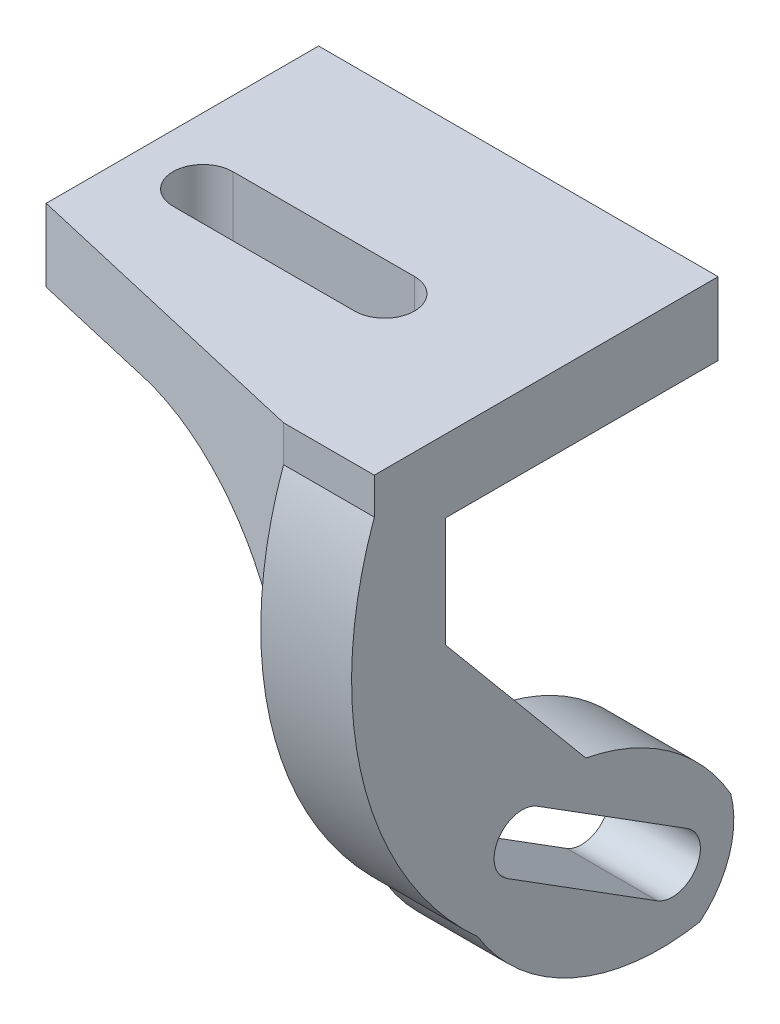
ISO-10303-21;
HEADER;
FILE_DESCRIPTION(('STEP AP214'),'2;1');
FILE_NAME('part.step','',(''),(''),'','','');
FILE_SCHEMA(('AUTOMOTIVE_DESIGN { 1 0 10303 214 1 1 1 1 }'));
ENDSEC;
DATA;
#1=APPLICATION_CONTEXT('core data for automotive mechanical design processes');
#2=APPLICATION_PROTOCOL_DEFINITION('international standard','automotive_design',2000,#1);
#3=PRODUCT_CONTEXT('',#1,'mechanical');
#4=PRODUCT('Part','Part','',(#3));
#5=PRODUCT_RELATED_PRODUCT_CATEGORY('part','',(#4));
#6=PRODUCT_DEFINITION_FORMATION('','',#4);
#7=PRODUCT_DEFINITION_CONTEXT('part definition',#1,'design');
#8=PRODUCT_DEFINITION('design','',#6,#7);
#9=PRODUCT_DEFINITION_SHAPE('','',#8);
#10=(LENGTH_UNIT() NAMED_UNIT(*) SI_UNIT(.MILLI.,.METRE.));
#11=(NAMED_UNIT(*) PLANE_ANGLE_UNIT() SI_UNIT($,.RADIAN.));
#12=(NAMED_UNIT(*) SI_UNIT($,.STERADIAN.) SOLID_ANGLE_UNIT());
#13=UNCERTAINTY_MEASURE_WITH_UNIT(LENGTH_MEASURE(1.E-05),#10,'distance_accuracy_value','');
#14=(GEOMETRIC_REPRESENTATION_CONTEXT(3) GLOBAL_UNCERTAINTY_ASSIGNED_CONTEXT((#13)) GLOBAL_UNIT_ASSIGNED_CONTEXT((#10,
#11,#12)) REPRESENTATION_CONTEXT('',''));
#15=CARTESIAN_POINT('',(0.,0.,0.));
#16=DIRECTION('',(0.,0.,1.));
#17=DIRECTION('',(1.,0.,0.));
#18=AXIS2_PLACEMENT_3D('',#15,#16,#17);
#19=CARTESIAN_POINT('',(0.,-5.17499782725623,-0.996742071947044));
#20=DIRECTION('',(1.,0.,0.));
#21=DIRECTION('',(0.,0.,-1.));
#22=AXIS2_PLACEMENT_3D('',#19,#20,#21);
#23=PLANE('',#22);
#24=CARTESIAN_POINT('',(0.,-22.7754113868742,2.52679453354434));
#25=DIRECTION('',(1.,0.,0.));
#26=DIRECTION('',(0.,0.,-1.));
#27=AXIS2_PLACEMENT_3D('',#24,#25,#26);
#28=CIRCLE('',#27,1.55);
#29=CARTESIAN_POINT('',(0.,-24.0876980381512,3.35166042863277));
#30=VERTEX_POINT('',#29);
#31=CARTESIAN_POINT('',(0.,-21.4631247355971,1.7019286384559));
#32=VERTEX_POINT('',#31);
#33=EDGE_CURVE('E327',#30,#32,#28,.T.);
#34=ORIENTED_EDGE('',*,*,#33,.T.);
#35=DIRECTION('',(0.,0.532171545218348,0.846636549211004));
#36=VECTOR('',#35,1.);
#37=CARTESIAN_POINT('',(0.,-21.4631247355971,1.7019286384559));
#38=LINE('',#37,#36);
#39=CARTESIAN_POINT('',(0.,-16.2710381983531,9.96206631134401));
#40=VERTEX_POINT('',#39);
#41=EDGE_CURVE('E324',#32,#40,#38,.T.);
#42=ORIENTED_EDGE('',*,*,#41,.T.);
#43=CARTESIAN_POINT('',(0.,-17.5833248496302,10.7869322064324));
#44=DIRECTION('',(1.,0.,0.));
#45=DIRECTION('',(0.,0.,-1.));
#46=AXIS2_PLACEMENT_3D('',#43,#44,#45);
#47=CIRCLE('',#46,1.55);
#48=CARTESIAN_POINT('',(0.,-18.8956115009073,11.6117981015209));
#49=VERTEX_POINT('',#48);
#50=EDGE_CURVE('E321',#40,#49,#47,.T.);
#51=ORIENTED_EDGE('',*,*,#50,.T.);
#52=DIRECTION('',(0.,-0.532171545218347,-0.846636549211004));
#53=VECTOR('',#52,1.);
#54=CARTESIAN_POINT('',(0.,-24.0876980381512,3.35166042863277));
#55=LINE('',#54,#53);
#56=EDGE_CURVE('E317',#49,#30,#55,.T.);
#57=ORIENTED_EDGE('',*,*,#56,.T.);
#58=EDGE_LOOP('',(#34,#42,#51,#57));
#59=FACE_BOUND('',#58,.T.);
#60=DIRECTION('',(0.,1.,0.));
#61=VECTOR('',#60,1.);
#62=CARTESIAN_POINT('',(0.,-17.4486809363276,18.9314712790204));
#63=LINE('',#62,#61);
#64=CARTESIAN_POINT('',(0.,-10.,18.9314712790204));
#65=VERTEX_POINT('',#64);
#66=CARTESIAN_POINT('',(0.,1.99999999999997,18.9314712790204));
#67=VERTEX_POINT('',#66);
#68=EDGE_CURVE('E55',#65,#67,#63,.T.);
#69=ORIENTED_EDGE('',*,*,#68,.F.);
#70=DIRECTION('',(0.,0.,1.));
#71=VECTOR('',#70,1.);
#72=CARTESIAN_POINT('',(0.,-10.,15.));
#73=LINE('',#72,#71);
#74=CARTESIAN_POINT('',(0.,-10.,11.7200708991023));
#75=VERTEX_POINT('',#74);
#76=EDGE_CURVE('E223',#65,#75,#73,.F.);
#77=ORIENTED_EDGE('',*,*,#76,.T.);
#78=DIRECTION('',(0.,0.767524612219118,0.641019476800739));
#79=VECTOR('',#78,1.);
#80=CARTESIAN_POINT('',(0.,-6.07277718949055,15.));
#81=LINE('',#80,#79);
#82=CARTESIAN_POINT('',(0.,-15.3113975849205,7.28410982793541));
#83=VERTEX_POINT('',#82);
#84=EDGE_CURVE('E234',#83,#75,#81,.T.);
#85=ORIENTED_EDGE('',*,*,#84,.F.);
#86=CARTESIAN_POINT('',(0.,-26.8741059425083,9.5155777960902));
#87=DIRECTION('',(1.,0.,0.));
#88=DIRECTION('',(0.,0.,-1.));
#89=AXIS2_PLACEMENT_3D('',#86,#87,#88);
#90=CIRCLE('',#89,11.7760635976344);
#91=CARTESIAN_POINT('',(0.,-21.0040909671596,-0.693173256056763));
#92=VERTEX_POINT('',#91);
#93=EDGE_CURVE('E263',#92,#83,#90,.T.);
#94=ORIENTED_EDGE('',*,*,#93,.F.);
#95=CARTESIAN_POINT('',(0.,-22.3180624062532,4.22975541027439));
#96=DIRECTION('',(1.,0.,0.));
#97=DIRECTION('',(0.,0.,1.));
#98=AXIS2_PLACEMENT_3D('',#95,#96,#97);
#99=CIRCLE('',#98,5.09526717616838);
#100=CARTESIAN_POINT('',(0.,-26.2653331302503,1.00783029816914));
#101=VERTEX_POINT('',#100);
#102=EDGE_CURVE('E261',#101,#92,#99,.T.);
#103=ORIENTED_EDGE('',*,*,#102,.F.);
#104=CARTESIAN_POINT('',(0.,-14.6231002179841,3.17376758072072));
#105=DIRECTION('',(1.,0.,0.));
#106=DIRECTION('',(0.,0.,-1.));
#107=AXIS2_PLACEMENT_3D('',#104,#105,#106);
#108=CIRCLE('',#107,11.841996094215);
#109=CARTESIAN_POINT('',(0.,-20.852951582252,13.2446078373494));
#110=VERTEX_POINT('',#109);
#111=EDGE_CURVE('E259',#110,#101,#108,.T.);
#112=ORIENTED_EDGE('',*,*,#111,.F.);
#113=CARTESIAN_POINT('',(0.,-5.17499782725623,-0.996742071947044));
#114=DIRECTION('',(1.,0.,0.));
#115=DIRECTION('',(0.,0.,-1.));
#116=AXIS2_PLACEMENT_3D('',#113,#114,#115);
#117=CIRCLE('',#116,21.1805165466475);
#118=EDGE_CURVE('E184',#67,#110,#117,.T.);
#119=ORIENTED_EDGE('',*,*,#118,.F.);
#120=EDGE_LOOP('',(#69,#77,#85,#94,#103,#112,#119));
#121=FACE_BOUND('',#120,.T.);
#122=ADVANCED_FACE('F33',(#59,#121),#23,.F.);
#123=CARTESIAN_POINT('',(5.,-5.17499782725623,-0.996742071947044));
#124=DIRECTION('',(1.,0.,0.));
#125=DIRECTION('',(0.,0.,-1.));
#126=AXIS2_PLACEMENT_3D('',#123,#124,#125);
#127=PLANE('',#126);
#128=DIRECTION('',(0.,1.,0.));
#129=VECTOR('',#128,1.);
#130=CARTESIAN_POINT('',(5.,0.,0.));
#131=LINE('',#130,#129);
#132=CARTESIAN_POINT('',(5.,0.,0.));
#133=VERTEX_POINT('',#132);
#134=CARTESIAN_POINT('',(5.,3.99999999999998,0.));
#135=VERTEX_POINT('',#134);
#136=EDGE_CURVE('E265',#133,#135,#131,.T.);
#137=ORIENTED_EDGE('',*,*,#136,.T.);
#138=DIRECTION('',(0.,0.,1.));
#139=VECTOR('',#138,1.);
#140=CARTESIAN_POINT('',(5.,3.99999999999998,18.9314712790204));
#141=LINE('',#140,#139);
#142=CARTESIAN_POINT('',(5.,3.99999999999998,18.9314712790204));
#143=VERTEX_POINT('',#142);
#144=EDGE_CURVE('E304',#135,#143,#141,.T.);
#145=ORIENTED_EDGE('',*,*,#144,.T.);
#146=DIRECTION('',(0.,-1.,0.));
#147=VECTOR('',#146,1.);
#148=CARTESIAN_POINT('',(5.,2.,18.9314712790204));
#149=LINE('',#148,#147);
#150=CARTESIAN_POINT('',(5.,2.,18.9314712790204));
#151=VERTEX_POINT('',#150);
#152=EDGE_CURVE('E199',#143,#151,#149,.T.);
#153=ORIENTED_EDGE('',*,*,#152,.T.);
#154=CARTESIAN_POINT('',(5.,-5.17499782725623,-0.996742071947044));
#155=DIRECTION('',(1.,0.,0.));
#156=DIRECTION('',(0.,0.,-1.));
#157=AXIS2_PLACEMENT_3D('',#154,#155,#156);
#158=CIRCLE('',#157,21.1805165466475);
#159=CARTESIAN_POINT('',(5.,-20.852951582252,13.2446078373494));
#160=VERTEX_POINT('',#159);
#161=EDGE_CURVE('E301',#151,#160,#158,.T.);
#162=ORIENTED_EDGE('',*,*,#161,.T.);
#163=CARTESIAN_POINT('',(5.,-14.6231002179841,3.17376758072072));
#164=DIRECTION('',(1.,0.,0.));
#165=DIRECTION('',(0.,0.,-1.));
#166=AXIS2_PLACEMENT_3D('',#163,#164,#165);
#167=CIRCLE('',#166,11.841996094215);
#168=CARTESIAN_POINT('',(5.,-26.2653331302503,1.00783029816914));
#169=VERTEX_POINT('',#168);
#170=EDGE_CURVE('E282',#160,#169,#167,.T.);
#171=ORIENTED_EDGE('',*,*,#170,.T.);
#172=CARTESIAN_POINT('',(5.,-22.3180624062532,4.22975541027439));
#173=DIRECTION('',(1.,0.,0.));
#174=DIRECTION('',(0.,0.,1.));
#175=AXIS2_PLACEMENT_3D('',#172,#173,#174);
#176=CIRCLE('',#175,5.09526717616838);
#177=CARTESIAN_POINT('',(5.,-21.0040909671596,-0.693173256056763));
#178=VERTEX_POINT('',#177);
#179=EDGE_CURVE('E296',#169,#178,#176,.T.);
#180=ORIENTED_EDGE('',*,*,#179,.T.);
#181=CARTESIAN_POINT('',(5.,-26.8741059425083,9.5155777960902));
#182=DIRECTION('',(1.,0.,0.));
#183=DIRECTION('',(0.,0.,-1.));
#184=AXIS2_PLACEMENT_3D('',#181,#182,#183);
#185=CIRCLE('',#184,11.7760635976344);
#186=CARTESIAN_POINT('',(5.,-15.3113975849205,7.28410982793541));
#187=VERTEX_POINT('',#186);
#188=EDGE_CURVE('E295',#178,#187,#185,.T.);
#189=ORIENTED_EDGE('',*,*,#188,.T.);
#190=DIRECTION('',(0.,0.767524612219118,0.641019476800739));
#191=VECTOR('',#190,1.);
#192=CARTESIAN_POINT('',(5.,-6.07277718949055,15.));
#193=LINE('',#192,#191);
#194=CARTESIAN_POINT('',(5.,-6.07277718949055,15.));
#195=VERTEX_POINT('',#194);
#196=EDGE_CURVE('E254',#187,#195,#193,.T.);
#197=ORIENTED_EDGE('',*,*,#196,.T.);
#198=DIRECTION('',(0.,1.,0.));
#199=VECTOR('',#198,1.);
#200=CARTESIAN_POINT('',(5.,0.,15.));
#201=LINE('',#200,#199);
#202=CARTESIAN_POINT('',(5.,0.,15.));
#203=VERTEX_POINT('',#202);
#204=EDGE_CURVE('E242',#195,#203,#201,.T.);
#205=ORIENTED_EDGE('',*,*,#204,.T.);
#206=DIRECTION('',(0.,0.,-1.));
#207=VECTOR('',#206,1.);
#208=CARTESIAN_POINT('',(5.,0.,0.));
#209=LINE('',#208,#207);
#210=EDGE_CURVE('E247',#203,#133,#209,.T.);
#211=ORIENTED_EDGE('',*,*,#210,.T.);
#212=EDGE_LOOP('',(#137,#145,#153,#162,#171,#180,#189,#197,#205,#211));
#213=FACE_BOUND('',#212,.T.);
#214=DIRECTION('',(0.,0.532171545218348,0.846636549211004));
#215=VECTOR('',#214,1.);
#216=CARTESIAN_POINT('',(5.,-21.4631247355971,1.7019286384559));
#217=LINE('',#216,#215);
#218=CARTESIAN_POINT('',(5.,-21.4631247355971,1.7019286384559));
#219=VERTEX_POINT('',#218);
#220=CARTESIAN_POINT('',(5.,-16.2710381983531,9.96206631134401));
#221=VERTEX_POINT('',#220);
#222=EDGE_CURVE('E334',#219,#221,#217,.T.);
#223=ORIENTED_EDGE('',*,*,#222,.F.);
#224=CARTESIAN_POINT('',(5.,-22.7754113868742,2.52679453354434));
#225=DIRECTION('',(1.,0.,0.));
#226=DIRECTION('',(0.,0.,-1.));
#227=AXIS2_PLACEMENT_3D('',#224,#225,#226);
#228=CIRCLE('',#227,1.55);
#229=CARTESIAN_POINT('',(5.,-24.0876980381512,3.35166042863277));
#230=VERTEX_POINT('',#229);
#231=EDGE_CURVE('E320',#230,#219,#228,.T.);
#232=ORIENTED_EDGE('',*,*,#231,.F.);
#233=DIRECTION('',(0.,-0.532171545218347,-0.846636549211004));
#234=VECTOR('',#233,1.);
#235=CARTESIAN_POINT('',(5.,-24.0876980381512,3.35166042863277));
#236=LINE('',#235,#234);
#237=CARTESIAN_POINT('',(5.,-18.8956115009073,11.6117981015209));
#238=VERTEX_POINT('',#237);
#239=EDGE_CURVE('E316',#238,#230,#236,.T.);
#240=ORIENTED_EDGE('',*,*,#239,.F.);
#241=CARTESIAN_POINT('',(5.,-17.5833248496302,10.7869322064324));
#242=DIRECTION('',(1.,0.,0.));
#243=DIRECTION('',(0.,0.,-1.));
#244=AXIS2_PLACEMENT_3D('',#241,#242,#243);
#245=CIRCLE('',#244,1.55);
#246=EDGE_CURVE('E331',#221,#238,#245,.T.);
#247=ORIENTED_EDGE('',*,*,#246,.F.);
#248=EDGE_LOOP('',(#223,#232,#240,#247));
#249=FACE_BOUND('',#248,.T.);
#250=ADVANCED_FACE('F374',(#213,#249),#127,.T.);
#251=CARTESIAN_POINT('',(5.,3.99999999999998,0.));
#252=DIRECTION('',(0.,0.,1.));
#253=DIRECTION('',(0.,-1.,0.));
#254=AXIS2_PLACEMENT_3D('',#251,#252,#253);
#255=PLANE('',#254);
#256=DIRECTION('',(-1.,0.,0.));
#257=VECTOR('',#256,1.);
#258=CARTESIAN_POINT('',(5.,0.,0.));
#259=LINE('',#258,#257);
#260=CARTESIAN_POINT('',(-17.,0.,0.));
#261=VERTEX_POINT('',#260);
#262=EDGE_CURVE('E244',#133,#261,#259,.T.);
#263=ORIENTED_EDGE('',*,*,#262,.T.);
#264=DIRECTION('',(0.,-1.,0.));
#265=VECTOR('',#264,1.);
#266=CARTESIAN_POINT('',(-17.,3.99999999999998,0.));
#267=LINE('',#266,#265);
#268=CARTESIAN_POINT('',(-17.,3.99999999999998,0.));
#269=VERTEX_POINT('',#268);
#270=EDGE_CURVE('E343',#269,#261,#267,.T.);
#271=ORIENTED_EDGE('',*,*,#270,.F.);
#272=DIRECTION('',(-1.,0.,0.));
#273=VECTOR('',#272,1.);
#274=CARTESIAN_POINT('',(5.,3.99999999999998,0.));
#275=LINE('',#274,#273);
#276=EDGE_CURVE('E200',#135,#269,#275,.T.);
#277=ORIENTED_EDGE('',*,*,#276,.F.);
#278=ORIENTED_EDGE('',*,*,#136,.F.);
#279=EDGE_LOOP('',(#263,#271,#277,#278));
#280=FACE_BOUND('',#279,.T.);
#281=ADVANCED_FACE('F373',(#280),#255,.F.);
#282=CARTESIAN_POINT('',(5.,3.99999999999998,18.9314712790204));
#283=DIRECTION('',(0.,-1.,0.));
#284=DIRECTION('',(0.,0.,-1.));
#285=AXIS2_PLACEMENT_3D('',#282,#283,#284);
#286=PLANE('',#285);
#287=DIRECTION('',(0.974285681653249,0.,0.225316245587094));
#288=VECTOR('',#287,1.);
#289=CARTESIAN_POINT('',(-17.,3.99999999999998,15.));
#290=LINE('',#289,#288);
#291=CARTESIAN_POINT('',(-17.,3.99999999999998,15.));
#292=VERTEX_POINT('',#291);
#293=CARTESIAN_POINT('',(0.,3.99999999999998,18.9314712790204));
#294=VERTEX_POINT('',#293);
#295=EDGE_CURVE('E178',#292,#294,#290,.T.);
#296=ORIENTED_EDGE('',*,*,#295,.T.);
#297=DIRECTION('',(-1.,0.,0.));
#298=VECTOR('',#297,1.);
#299=CARTESIAN_POINT('',(5.,3.99999999999998,18.9314712790204));
#300=LINE('',#299,#298);
#301=EDGE_CURVE('E193',#143,#294,#300,.T.);
#302=ORIENTED_EDGE('',*,*,#301,.F.);
#303=ORIENTED_EDGE('',*,*,#144,.F.);
#304=ORIENTED_EDGE('',*,*,#276,.T.);
#305=DIRECTION('',(0.,0.,-1.));
#306=VECTOR('',#305,1.);
#307=CARTESIAN_POINT('',(-17.,3.99999999999998,15.));
#308=LINE('',#307,#306);
#309=EDGE_CURVE('E196',#292,#269,#308,.T.);
#310=ORIENTED_EDGE('',*,*,#309,.F.);
#311=EDGE_LOOP('',(#296,#302,#303,#304,#310));
#312=FACE_BOUND('',#311,.T.);
#313=DIRECTION('',(-1.,0.,0.));
#314=VECTOR('',#313,1.);
#315=CARTESIAN_POINT('',(-3.36829799390778,3.99999999999998,8.35000000005735));
#316=LINE('',#315,#314);
#317=CARTESIAN_POINT('',(-3.36829799390778,3.99999999999998,8.35000000005735));
#318=VERTEX_POINT('',#317);
#319=CARTESIAN_POINT('',(-13.3682979939078,3.99999999999998,8.35000000005743));
#320=VERTEX_POINT('',#319);
#321=EDGE_CURVE('E361',#318,#320,#316,.T.);
#322=ORIENTED_EDGE('',*,*,#321,.F.);
#323=CARTESIAN_POINT('',(-3.36829799390778,3.99999999999998,10.0000000000574));
#324=DIRECTION('',(0.,1.,0.));
#325=DIRECTION('',(0.,0.,1.));
#326=AXIS2_PLACEMENT_3D('',#323,#324,#325);
#327=CIRCLE('',#326,1.65);
#328=CARTESIAN_POINT('',(-3.36829799390778,3.99999999999998,11.6500000000574));
#329=VERTEX_POINT('',#328);
#330=EDGE_CURVE('E364',#329,#318,#327,.T.);
#331=ORIENTED_EDGE('',*,*,#330,.F.);
#332=DIRECTION('',(1.,0.,0.));
#333=VECTOR('',#332,1.);
#334=CARTESIAN_POINT('',(-3.36829799390778,3.99999999999998,11.6500000000574));
#335=LINE('',#334,#333);
#336=CARTESIAN_POINT('',(-13.3682979939078,3.99999999999998,11.6500000000574));
#337=VERTEX_POINT('',#336);
#338=EDGE_CURVE('E351',#337,#329,#335,.T.);
#339=ORIENTED_EDGE('',*,*,#338,.F.);
#340=CARTESIAN_POINT('',(-13.3682979939078,3.99999999999998,10.0000000000574));
#341=DIRECTION('',(0.,1.,0.));
#342=DIRECTION('',(0.,0.,1.));
#343=AXIS2_PLACEMENT_3D('',#340,#341,#342);
#344=CIRCLE('',#343,1.65);
#345=EDGE_CURVE('E358',#320,#337,#344,.T.);
#346=ORIENTED_EDGE('',*,*,#345,.F.);
#347=EDGE_LOOP('',(#322,#331,#339,#346));
#348=FACE_BOUND('',#347,.T.);
#349=ADVANCED_FACE('F190',(#312,#348),#286,.F.);
#350=CARTESIAN_POINT('',(5.,2.,18.9314712790204));
#351=DIRECTION('',(0.,0.,-1.));
#352=DIRECTION('',(0.,1.,0.));
#353=AXIS2_PLACEMENT_3D('',#350,#351,#352);
#354=PLANE('',#353);
#355=DIRECTION('',(0.,-1.,0.));
#356=VECTOR('',#355,1.);
#357=CARTESIAN_POINT('',(0.,2.,18.9314712790204));
#358=LINE('',#357,#356);
#359=EDGE_CURVE('E173',#294,#67,#358,.T.);
#360=ORIENTED_EDGE('',*,*,#359,.T.);
#361=DIRECTION('',(-1.,0.,0.));
#362=VECTOR('',#361,1.);
#363=CARTESIAN_POINT('',(5.,2.,18.9314712790204));
#364=LINE('',#363,#362);
#365=EDGE_CURVE('E201',#151,#67,#364,.T.);
#366=ORIENTED_EDGE('',*,*,#365,.F.);
#367=ORIENTED_EDGE('',*,*,#152,.F.);
#368=ORIENTED_EDGE('',*,*,#301,.T.);
#369=EDGE_LOOP('',(#360,#366,#367,#368));
#370=FACE_BOUND('',#369,.T.);
#371=ADVANCED_FACE('F198',(#370),#354,.F.);
#372=CARTESIAN_POINT('',(5.,-5.17499782725623,-0.996742071947044));
#373=DIRECTION('',(-1.,0.,0.));
#374=DIRECTION('',(0.,0.,1.));
#375=AXIS2_PLACEMENT_3D('',#372,#373,#374);
#376=CYLINDRICAL_SURFACE('',#375,21.1805165466475);
#377=ORIENTED_EDGE('',*,*,#118,.T.);
#378=DIRECTION('',(-1.,0.,0.));
#379=VECTOR('',#378,1.);
#380=CARTESIAN_POINT('',(5.,-20.852951582252,13.2446078373494));
#381=LINE('',#380,#379);
#382=EDGE_CURVE('E205',#160,#110,#381,.T.);
#383=ORIENTED_EDGE('',*,*,#382,.F.);
#384=ORIENTED_EDGE('',*,*,#161,.F.);
#385=ORIENTED_EDGE('',*,*,#365,.T.);
#386=EDGE_LOOP('',(#377,#383,#384,#385));
#387=FACE_BOUND('',#386,.T.);
#388=ADVANCED_FACE('F376',(#387),#376,.T.);
#389=CARTESIAN_POINT('',(5.,-14.6231002179841,3.17376758072072));
#390=DIRECTION('',(-1.,0.,0.));
#391=DIRECTION('',(0.,0.,1.));
#392=AXIS2_PLACEMENT_3D('',#389,#390,#391);
#393=CYLINDRICAL_SURFACE('',#392,11.841996094215);
#394=ORIENTED_EDGE('',*,*,#111,.T.);
#395=DIRECTION('',(-1.,0.,0.));
#396=VECTOR('',#395,1.);
#397=CARTESIAN_POINT('',(5.,-26.2653331302503,1.00783029816914));
#398=LINE('',#397,#396);
#399=EDGE_CURVE('E273',#169,#101,#398,.T.);
#400=ORIENTED_EDGE('',*,*,#399,.F.);
#401=ORIENTED_EDGE('',*,*,#170,.F.);
#402=ORIENTED_EDGE('',*,*,#382,.T.);
#403=EDGE_LOOP('',(#394,#400,#401,#402));
#404=FACE_BOUND('',#403,.T.);
#405=ADVANCED_FACE('F280',(#404),#393,.T.);
#406=CARTESIAN_POINT('',(5.,-22.3180624062532,4.22975541027439));
#407=DIRECTION('',(-1.,0.,0.));
#408=DIRECTION('',(0.,0.,1.));
#409=AXIS2_PLACEMENT_3D('',#406,#407,#408);
#410=CYLINDRICAL_SURFACE('',#409,5.09526717616838);
#411=ORIENTED_EDGE('',*,*,#102,.T.);
#412=DIRECTION('',(-1.,0.,0.));
#413=VECTOR('',#412,1.);
#414=CARTESIAN_POINT('',(5.,-21.0040909671596,-0.693173256056763));
#415=LINE('',#414,#413);
#416=EDGE_CURVE('E270',#178,#92,#415,.T.);
#417=ORIENTED_EDGE('',*,*,#416,.F.);
#418=ORIENTED_EDGE('',*,*,#179,.F.);
#419=ORIENTED_EDGE('',*,*,#399,.T.);
#420=EDGE_LOOP('',(#411,#417,#418,#419));
#421=FACE_BOUND('',#420,.T.);
#422=ADVANCED_FACE('F289',(#421),#410,.T.);
#423=CARTESIAN_POINT('',(5.,-26.8741059425083,9.5155777960902));
#424=DIRECTION('',(-1.,0.,0.));
#425=DIRECTION('',(0.,0.,1.));
#426=AXIS2_PLACEMENT_3D('',#423,#424,#425);
#427=CYLINDRICAL_SURFACE('',#426,11.7760635976344);
#428=ORIENTED_EDGE('',*,*,#93,.T.);
#429=DIRECTION('',(-1.,0.,0.));
#430=VECTOR('',#429,1.);
#431=CARTESIAN_POINT('',(5.,-15.3113975849205,7.28410982793541));
#432=LINE('',#431,#430);
#433=EDGE_CURVE('E268',#187,#83,#432,.T.);
#434=ORIENTED_EDGE('',*,*,#433,.F.);
#435=ORIENTED_EDGE('',*,*,#188,.F.);
#436=ORIENTED_EDGE('',*,*,#416,.T.);
#437=EDGE_LOOP('',(#428,#434,#435,#436));
#438=FACE_BOUND('',#437,.T.);
#439=ADVANCED_FACE('F293',(#438),#427,.T.);
#440=CARTESIAN_POINT('',(5.,-6.07277718949055,15.));
#441=DIRECTION('',(0.,-0.641019476800739,0.767524612219118));
#442=DIRECTION('',(0.,-0.767524612219118,-0.641019476800739));
#443=AXIS2_PLACEMENT_3D('',#440,#441,#442);
#444=PLANE('',#443);
#445=ORIENTED_EDGE('',*,*,#84,.T.);
#446=CARTESIAN_POINT('',(-10.,-10.,11.7200708991023));
#447=DIRECTION('',(0.,-0.641019476800739,0.767524612219118));
#448=DIRECTION('',(0.,-0.767524612219118,-0.641019476800739));
#449=AXIS2_PLACEMENT_3D('',#446,#447,#448);
#450=ELLIPSE('',#449,13.0288981497119,10.);
#451=CARTESIAN_POINT('',(-0.803428845672194,-6.07277718949055,15.));
#452=VERTEX_POINT('',#451);
#453=EDGE_CURVE('E41',#75,#452,#450,.T.);
#454=ORIENTED_EDGE('',*,*,#453,.T.);
#455=DIRECTION('',(-1.,0.,0.));
#456=VECTOR('',#455,1.);
#457=CARTESIAN_POINT('',(5.,-6.07277718949055,15.));
#458=LINE('',#457,#456);
#459=EDGE_CURVE('E47',#195,#452,#458,.T.);
#460=ORIENTED_EDGE('',*,*,#459,.F.);
#461=ORIENTED_EDGE('',*,*,#196,.F.);
#462=ORIENTED_EDGE('',*,*,#433,.T.);
#463=EDGE_LOOP('',(#445,#454,#460,#461,#462));
#464=FACE_BOUND('',#463,.T.);
#465=ADVANCED_FACE('F230',(#464),#444,.F.);
#466=CARTESIAN_POINT('',(5.,0.,15.));
#467=DIRECTION('',(0.,0.,1.));
#468=DIRECTION('',(1.,0.,0.));
#469=AXIS2_PLACEMENT_3D('',#466,#467,#468);
#470=PLANE('',#469);
#471=ORIENTED_EDGE('',*,*,#459,.T.);
#472=CARTESIAN_POINT('',(-10.,-10.,15.));
#473=DIRECTION('',(0.,0.,1.));
#474=DIRECTION('',(1.,0.,0.));
#475=AXIS2_PLACEMENT_3D('',#472,#473,#474);
#476=CIRCLE('',#475,10.);
#477=CARTESIAN_POINT('',(-10.,0.,15.));
#478=VERTEX_POINT('',#477);
#479=EDGE_CURVE('E11',#452,#478,#476,.T.);
#480=ORIENTED_EDGE('',*,*,#479,.T.);
#481=DIRECTION('',(-1.,0.,0.));
#482=VECTOR('',#481,1.);
#483=CARTESIAN_POINT('',(5.,0.,15.));
#484=LINE('',#483,#482);
#485=EDGE_CURVE('E240',#203,#478,#484,.T.);
#486=ORIENTED_EDGE('',*,*,#485,.F.);
#487=ORIENTED_EDGE('',*,*,#204,.F.);
#488=EDGE_LOOP('',(#471,#480,#486,#487));
#489=FACE_BOUND('',#488,.T.);
#490=ADVANCED_FACE('F239',(#489),#470,.F.);
#491=CARTESIAN_POINT('',(5.,0.,0.));
#492=DIRECTION('',(0.,1.,0.));
#493=DIRECTION('',(0.,0.,1.));
#494=AXIS2_PLACEMENT_3D('',#491,#492,#493);
#495=PLANE('',#494);
#496=DIRECTION('',(1.,0.,0.));
#497=VECTOR('',#496,1.);
#498=CARTESIAN_POINT('',(5.,0.,11.6500000000574));
#499=LINE('',#498,#497);
#500=CARTESIAN_POINT('',(-13.3682979939078,0.,11.6500000000574));
#501=VERTEX_POINT('',#500);
#502=CARTESIAN_POINT('',(-3.36829799390778,0.,11.6500000000574));
#503=VERTEX_POINT('',#502);
#504=EDGE_CURVE('E214',#501,#503,#499,.T.);
#505=ORIENTED_EDGE('',*,*,#504,.T.);
#506=CARTESIAN_POINT('',(-3.36829799390778,0.,10.0000000000574));
#507=DIRECTION('',(0.,1.,0.));
#508=DIRECTION('',(0.,0.,1.));
#509=AXIS2_PLACEMENT_3D('',#506,#507,#508);
#510=CIRCLE('',#509,1.65);
#511=CARTESIAN_POINT('',(-3.36829799390778,0.,8.35000000005735));
#512=VERTEX_POINT('',#511);
#513=EDGE_CURVE('E217',#503,#512,#510,.T.);
#514=ORIENTED_EDGE('',*,*,#513,.T.);
#515=DIRECTION('',(-1.,0.,0.));
#516=VECTOR('',#515,1.);
#517=CARTESIAN_POINT('',(5.,0.,8.35000000005735));
#518=LINE('',#517,#516);
#519=CARTESIAN_POINT('',(-13.3682979939078,0.,8.35000000005736));
#520=VERTEX_POINT('',#519);
#521=EDGE_CURVE('E203',#512,#520,#518,.T.);
#522=ORIENTED_EDGE('',*,*,#521,.T.);
#523=CARTESIAN_POINT('',(-13.3682979939078,0.,10.0000000000574));
#524=DIRECTION('',(0.,1.,0.));
#525=DIRECTION('',(0.,0.,1.));
#526=AXIS2_PLACEMENT_3D('',#523,#524,#525);
#527=CIRCLE('',#526,1.65);
#528=EDGE_CURVE('E211',#520,#501,#527,.T.);
#529=ORIENTED_EDGE('',*,*,#528,.T.);
#530=EDGE_LOOP('',(#505,#514,#522,#529));
#531=FACE_BOUND('',#530,.T.);
#532=ORIENTED_EDGE('',*,*,#485,.T.);
#533=DIRECTION('',(0.,0.,1.));
#534=VECTOR('',#533,1.);
#535=CARTESIAN_POINT('',(-10.,0.,18.9314712790204));
#536=LINE('',#535,#534);
#537=CARTESIAN_POINT('',(-9.99999999999999,0.,16.6188411148908));
#538=VERTEX_POINT('',#537);
#539=EDGE_CURVE('E220',#478,#538,#536,.T.);
#540=ORIENTED_EDGE('',*,*,#539,.T.);
#541=DIRECTION('',(-0.974285681653249,0.,-0.225316245587094));
#542=VECTOR('',#541,1.);
#543=CARTESIAN_POINT('',(-17.,0.,15.));
#544=LINE('',#543,#542);
#545=CARTESIAN_POINT('',(-17.,0.,15.));
#546=VERTEX_POINT('',#545);
#547=EDGE_CURVE('E366',#538,#546,#544,.T.);
#548=ORIENTED_EDGE('',*,*,#547,.T.);
#549=DIRECTION('',(0.,0.,1.));
#550=VECTOR('',#549,1.);
#551=CARTESIAN_POINT('',(-17.,0.,0.));
#552=LINE('',#551,#550);
#553=EDGE_CURVE('E340',#261,#546,#552,.T.);
#554=ORIENTED_EDGE('',*,*,#553,.F.);
#555=ORIENTED_EDGE('',*,*,#262,.F.);
#556=ORIENTED_EDGE('',*,*,#210,.F.);
#557=EDGE_LOOP('',(#532,#540,#548,#554,#555,#556));
#558=FACE_BOUND('',#557,.T.);
#559=ADVANCED_FACE('F248',(#531,#558),#495,.F.);
#560=CARTESIAN_POINT('',(5.,-22.7754113868742,2.52679453354434));
#561=DIRECTION('',(-1.,0.,0.));
#562=DIRECTION('',(0.,0.,1.));
#563=AXIS2_PLACEMENT_3D('',#560,#561,#562);
#564=CYLINDRICAL_SURFACE('',#563,1.55);
#565=ORIENTED_EDGE('',*,*,#33,.F.);
#566=DIRECTION('',(-1.,0.,0.));
#567=VECTOR('',#566,1.);
#568=CARTESIAN_POINT('',(5.,-24.0876980381512,3.35166042863277));
#569=LINE('',#568,#567);
#570=EDGE_CURVE('E313',#230,#30,#569,.T.);
#571=ORIENTED_EDGE('',*,*,#570,.F.);
#572=ORIENTED_EDGE('',*,*,#231,.T.);
#573=DIRECTION('',(-1.,0.,0.));
#574=VECTOR('',#573,1.);
#575=CARTESIAN_POINT('',(5.,-21.4631247355971,1.7019286384559));
#576=LINE('',#575,#574);
#577=EDGE_CURVE('E185',#219,#32,#576,.T.);
#578=ORIENTED_EDGE('',*,*,#577,.T.);
#579=EDGE_LOOP('',(#565,#571,#572,#578));
#580=FACE_BOUND('',#579,.T.);
#581=ADVANCED_FACE('F396',(#580),#564,.F.);
#582=CARTESIAN_POINT('',(5.,-21.4631247355971,1.7019286384559));
#583=DIRECTION('',(0.,-0.846636549211004,0.532171545218348));
#584=DIRECTION('',(0.,-0.532171545218348,-0.846636549211004));
#585=AXIS2_PLACEMENT_3D('',#582,#583,#584);
#586=PLANE('',#585);
#587=ORIENTED_EDGE('',*,*,#41,.F.);
#588=ORIENTED_EDGE('',*,*,#577,.F.);
#589=ORIENTED_EDGE('',*,*,#222,.T.);
#590=DIRECTION('',(-1.,0.,0.));
#591=VECTOR('',#590,1.);
#592=CARTESIAN_POINT('',(5.,-16.2710381983531,9.96206631134401));
#593=LINE('',#592,#591);
#594=EDGE_CURVE('E309',#221,#40,#593,.T.);
#595=ORIENTED_EDGE('',*,*,#594,.T.);
#596=EDGE_LOOP('',(#587,#588,#589,#595));
#597=FACE_BOUND('',#596,.T.);
#598=ADVANCED_FACE('F432',(#597),#586,.T.);
#599=CARTESIAN_POINT('',(5.,-17.5833248496302,10.7869322064324));
#600=DIRECTION('',(-1.,0.,0.));
#601=DIRECTION('',(0.,0.,1.));
#602=AXIS2_PLACEMENT_3D('',#599,#600,#601);
#603=CYLINDRICAL_SURFACE('',#602,1.55);
#604=ORIENTED_EDGE('',*,*,#50,.F.);
#605=ORIENTED_EDGE('',*,*,#594,.F.);
#606=ORIENTED_EDGE('',*,*,#246,.T.);
#607=DIRECTION('',(-1.,0.,0.));
#608=VECTOR('',#607,1.);
#609=CARTESIAN_POINT('',(5.,-18.8956115009073,11.6117981015209));
#610=LINE('',#609,#608);
#611=EDGE_CURVE('E311',#238,#49,#610,.T.);
#612=ORIENTED_EDGE('',*,*,#611,.T.);
#613=EDGE_LOOP('',(#604,#605,#606,#612));
#614=FACE_BOUND('',#613,.T.);
#615=ADVANCED_FACE('F439',(#614),#603,.F.);
#616=CARTESIAN_POINT('',(5.,-24.0876980381512,3.35166042863277));
#617=DIRECTION('',(0.,0.846636549211004,-0.532171545218347));
#618=DIRECTION('',(0.,0.532171545218347,0.846636549211004));
#619=AXIS2_PLACEMENT_3D('',#616,#617,#618);
#620=PLANE('',#619);
#621=ORIENTED_EDGE('',*,*,#56,.F.);
#622=ORIENTED_EDGE('',*,*,#611,.F.);
#623=ORIENTED_EDGE('',*,*,#239,.T.);
#624=ORIENTED_EDGE('',*,*,#570,.T.);
#625=EDGE_LOOP('',(#621,#622,#623,#624));
#626=FACE_BOUND('',#625,.T.);
#627=ADVANCED_FACE('F447',(#626),#620,.T.);
#628=CARTESIAN_POINT('',(-17.,0.,0.));
#629=DIRECTION('',(-1.,0.,0.));
#630=DIRECTION('',(0.,0.,1.));
#631=AXIS2_PLACEMENT_3D('',#628,#629,#630);
#632=PLANE('',#631);
#633=ORIENTED_EDGE('',*,*,#270,.T.);
#634=ORIENTED_EDGE('',*,*,#553,.T.);
#635=DIRECTION('',(0.,1.,0.));
#636=VECTOR('',#635,1.);
#637=CARTESIAN_POINT('',(-17.,2.,15.));
#638=LINE('',#637,#636);
#639=EDGE_CURVE('E338',#546,#292,#638,.T.);
#640=ORIENTED_EDGE('',*,*,#639,.T.);
#641=ORIENTED_EDGE('',*,*,#309,.T.);
#642=EDGE_LOOP('',(#633,#634,#640,#641));
#643=FACE_BOUND('',#642,.T.);
#644=ADVANCED_FACE('F369',(#643),#632,.T.);
#645=CARTESIAN_POINT('',(-3.36829799390778,-1.00000000000002,10.0000000000574));
#646=DIRECTION('',(0.,1.,0.));
#647=DIRECTION('',(0.,0.,1.));
#648=AXIS2_PLACEMENT_3D('',#645,#646,#647);
#649=CYLINDRICAL_SURFACE('',#648,1.65);
#650=DIRECTION('',(0.,1.,0.));
#651=VECTOR('',#650,1.);
#652=CARTESIAN_POINT('',(-3.36829799390778,-1.00000000000002,11.6500000000574));
#653=LINE('',#652,#651);
#654=EDGE_CURVE('E346',#503,#329,#653,.T.);
#655=ORIENTED_EDGE('',*,*,#654,.T.);
#656=ORIENTED_EDGE('',*,*,#330,.T.);
#657=DIRECTION('',(0.,1.,0.));
#658=VECTOR('',#657,1.);
#659=CARTESIAN_POINT('',(-3.36829799390778,-1.00000000000002,8.35000000005735));
#660=LINE('',#659,#658);
#661=EDGE_CURVE('E347',#512,#318,#660,.T.);
#662=ORIENTED_EDGE('',*,*,#661,.F.);
#663=ORIENTED_EDGE('',*,*,#513,.F.);
#664=EDGE_LOOP('',(#655,#656,#662,#663));
#665=FACE_BOUND('',#664,.T.);
#666=ADVANCED_FACE('F463',(#665),#649,.F.);
#667=CARTESIAN_POINT('',(-3.36829799390778,-1.00000000000002,11.6500000000574));
#668=DIRECTION('',(0.,0.,1.));
#669=DIRECTION('',(1.,0.,0.));
#670=AXIS2_PLACEMENT_3D('',#667,#668,#669);
#671=PLANE('',#670);
#672=DIRECTION('',(0.,1.,0.));
#673=VECTOR('',#672,1.);
#674=CARTESIAN_POINT('',(-13.3682979939078,-1.00000000000002,11.6500000000574));
#675=LINE('',#674,#673);
#676=EDGE_CURVE('E353',#501,#337,#675,.T.);
#677=ORIENTED_EDGE('',*,*,#676,.T.);
#678=ORIENTED_EDGE('',*,*,#338,.T.);
#679=ORIENTED_EDGE('',*,*,#654,.F.);
#680=ORIENTED_EDGE('',*,*,#504,.F.);
#681=EDGE_LOOP('',(#677,#678,#679,#680));
#682=FACE_BOUND('',#681,.T.);
#683=ADVANCED_FACE('F470',(#682),#671,.F.);
#684=CARTESIAN_POINT('',(-13.3682979939078,-1.00000000000002,10.0000000000574));
#685=DIRECTION('',(0.,1.,0.));
#686=DIRECTION('',(0.,0.,1.));
#687=AXIS2_PLACEMENT_3D('',#684,#685,#686);
#688=CYLINDRICAL_SURFACE('',#687,1.65);
#689=DIRECTION('',(0.,1.,0.));
#690=VECTOR('',#689,1.);
#691=CARTESIAN_POINT('',(-13.3682979939078,-1.00000000000002,8.35000000005743));
#692=LINE('',#691,#690);
#693=EDGE_CURVE('E350',#520,#320,#692,.T.);
#694=ORIENTED_EDGE('',*,*,#693,.T.);
#695=ORIENTED_EDGE('',*,*,#345,.T.);
#696=ORIENTED_EDGE('',*,*,#676,.F.);
#697=ORIENTED_EDGE('',*,*,#528,.F.);
#698=EDGE_LOOP('',(#694,#695,#696,#697));
#699=FACE_BOUND('',#698,.T.);
#700=ADVANCED_FACE('F478',(#699),#688,.F.);
#701=CARTESIAN_POINT('',(-3.36829799390778,-1.00000000000002,8.35000000005735));
#702=DIRECTION('',(0.,0.,-1.));
#703=DIRECTION('',(-1.,0.,0.));
#704=AXIS2_PLACEMENT_3D('',#701,#702,#703);
#705=PLANE('',#704);
#706=ORIENTED_EDGE('',*,*,#661,.T.);
#707=ORIENTED_EDGE('',*,*,#321,.T.);
#708=ORIENTED_EDGE('',*,*,#693,.F.);
#709=ORIENTED_EDGE('',*,*,#521,.F.);
#710=EDGE_LOOP('',(#706,#707,#708,#709));
#711=FACE_BOUND('',#710,.T.);
#712=ADVANCED_FACE('F486',(#711),#705,.F.);
#713=CARTESIAN_POINT('',(-17.,-17.4486809363276,15.));
#714=DIRECTION('',(-0.225316245587094,0.,0.974285681653249));
#715=DIRECTION('',(0.974285681653249,0.,0.225316245587094));
#716=AXIS2_PLACEMENT_3D('',#713,#714,#715);
#717=PLANE('',#716);
#718=ORIENTED_EDGE('',*,*,#547,.F.);
#719=CARTESIAN_POINT('',(-10.,-10.,16.6188411148908));
#720=DIRECTION('',(-0.225316245587094,0.,0.974285681653249));
#721=DIRECTION('',(-0.974285681653249,0.,-0.225316245587094));
#722=AXIS2_PLACEMENT_3D('',#719,#720,#721);
#723=ELLIPSE('',#722,10.2639299625457,10.);
#724=EDGE_CURVE('E225',#538,#65,#723,.F.);
#725=ORIENTED_EDGE('',*,*,#724,.T.);
#726=ORIENTED_EDGE('',*,*,#68,.T.);
#727=ORIENTED_EDGE('',*,*,#359,.F.);
#728=ORIENTED_EDGE('',*,*,#295,.F.);
#729=ORIENTED_EDGE('',*,*,#639,.F.);
#730=EDGE_LOOP('',(#718,#725,#726,#727,#728,#729));
#731=FACE_BOUND('',#730,.T.);
#732=ADVANCED_FACE('F176',(#731),#717,.T.);
#733=CARTESIAN_POINT('',(-10.,-10.,0.));
#734=DIRECTION('',(0.,0.,-1.));
#735=DIRECTION('',(0.,1.,0.));
#736=AXIS2_PLACEMENT_3D('',#733,#734,#735);
#737=CYLINDRICAL_SURFACE('',#736,10.);
#738=ORIENTED_EDGE('',*,*,#453,.F.);
#739=ORIENTED_EDGE('',*,*,#76,.F.);
#740=ORIENTED_EDGE('',*,*,#724,.F.);
#741=ORIENTED_EDGE('',*,*,#539,.F.);
#742=ORIENTED_EDGE('',*,*,#479,.F.);
#743=EDGE_LOOP('',(#738,#739,#740,#741,#742));
#744=FACE_BOUND('',#743,.T.);
#745=ADVANCED_FACE('F35',(#744),#737,.F.);
#746=CLOSED_SHELL('',(#122,#250,#281,#349,#371,#388,#405,#422,#439,#465,#490,#559,#581,#598,
#615,#627,#644,#666,#683,#700,#712,#732,#745));
#747=MANIFOLD_SOLID_BREP('B2',#746);
#748=ADVANCED_BREP_SHAPE_REPRESENTATION('',(#18,#747),#14);
#749=SHAPE_DEFINITION_REPRESENTATION(#9,#748);
ENDSEC;
END-ISO-10303-21;
